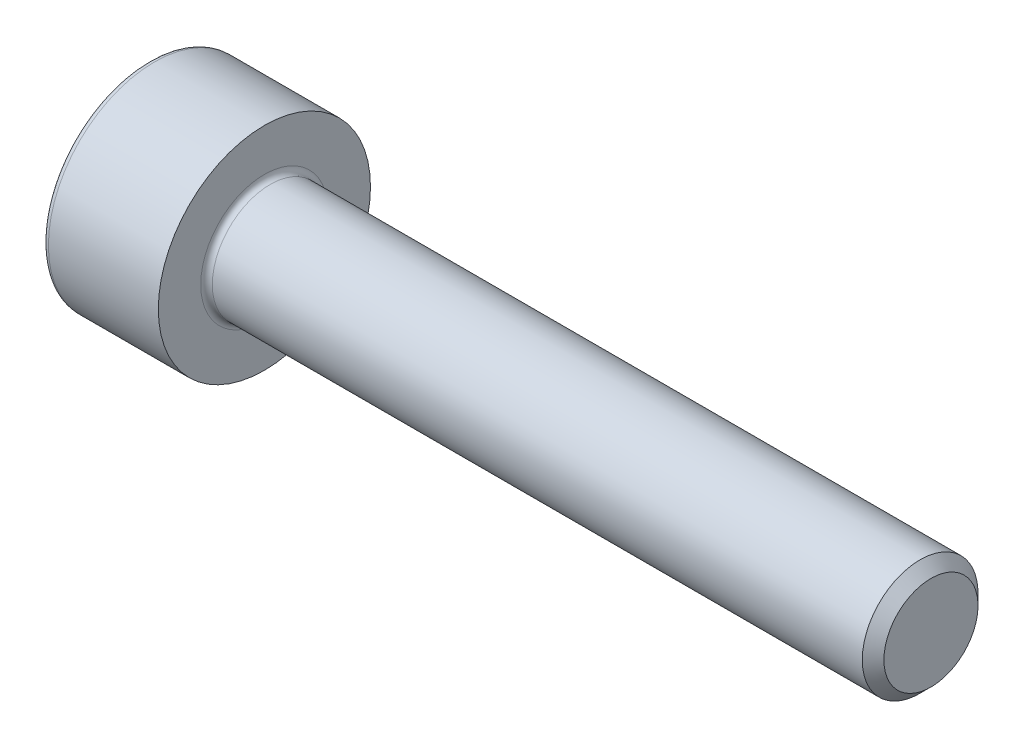
ISO-10303-21;
HEADER;
FILE_DESCRIPTION(('STEP AP214'),'2;1');
FILE_NAME('part.step','',(''),(''),'','','');
FILE_SCHEMA(('AUTOMOTIVE_DESIGN { 1 0 10303 214 1 1 1 1 }'));
ENDSEC;
DATA;
#1=APPLICATION_CONTEXT('core data for automotive mechanical design processes');
#2=APPLICATION_PROTOCOL_DEFINITION('international standard','automotive_design',2000,#1);
#3=PRODUCT_CONTEXT('',#1,'mechanical');
#4=PRODUCT('Part','Part','',(#3));
#5=PRODUCT_RELATED_PRODUCT_CATEGORY('part','',(#4));
#6=PRODUCT_DEFINITION_FORMATION('','',#4);
#7=PRODUCT_DEFINITION_CONTEXT('part definition',#1,'design');
#8=PRODUCT_DEFINITION('design','',#6,#7);
#9=PRODUCT_DEFINITION_SHAPE('','',#8);
#10=(LENGTH_UNIT() NAMED_UNIT(*) SI_UNIT(.MILLI.,.METRE.));
#11=(NAMED_UNIT(*) PLANE_ANGLE_UNIT() SI_UNIT($,.RADIAN.));
#12=(NAMED_UNIT(*) SI_UNIT($,.STERADIAN.) SOLID_ANGLE_UNIT());
#13=UNCERTAINTY_MEASURE_WITH_UNIT(LENGTH_MEASURE(1.E-05),#10,'distance_accuracy_value','');
#14=(GEOMETRIC_REPRESENTATION_CONTEXT(3) GLOBAL_UNCERTAINTY_ASSIGNED_CONTEXT((#13)) GLOBAL_UNIT_ASSIGNED_CONTEXT((#10,
#11,#12)) REPRESENTATION_CONTEXT('',''));
#15=CARTESIAN_POINT('',(0.,0.,0.));
#16=DIRECTION('',(0.,0.,1.));
#17=DIRECTION('',(1.,0.,0.));
#18=AXIS2_PLACEMENT_3D('',#15,#16,#17);
#19=CARTESIAN_POINT('',(-15.512494932035,0.,0.451171875000001));
#20=DIRECTION('',(-1.,0.,0.));
#21=DIRECTION('',(0.,0.,1.));
#22=AXIS2_PLACEMENT_3D('',#19,#20,#21);
#23=CYLINDRICAL_SURFACE('',#22,2.75);
#24=CARTESIAN_POINT('',(-11.29921875,0.,0.451171875000001));
#25=DIRECTION('',(1.,0.,0.));
#26=DIRECTION('',(0.,0.,-1.));
#27=AXIS2_PLACEMENT_3D('',#24,#25,#26);
#28=CIRCLE('',#27,2.75);
#29=CARTESIAN_POINT('',(-11.29921875,0.,-2.298828125));
#30=VERTEX_POINT('',#29);
#31=EDGE_CURVE('E11',#30,#30,#28,.T.);
#32=ORIENTED_EDGE('',*,*,#31,.T.);
#33=EDGE_LOOP('',(#32));
#34=FACE_BOUND('',#33,.T.);
#35=CARTESIAN_POINT('',(-8.44921875,0.,0.451171875000001));
#36=DIRECTION('',(-1.,0.,0.));
#37=DIRECTION('',(0.,0.,1.));
#38=AXIS2_PLACEMENT_3D('',#35,#36,#37);
#39=CIRCLE('',#38,2.75);
#40=CARTESIAN_POINT('',(-8.44921875,0.,3.201171875));
#41=VERTEX_POINT('',#40);
#42=EDGE_CURVE('E146',#41,#41,#39,.T.);
#43=ORIENTED_EDGE('',*,*,#42,.T.);
#44=EDGE_LOOP('',(#43));
#45=FACE_BOUND('',#44,.T.);
#46=ADVANCED_FACE('F33',(#34,#45),#23,.T.);
#47=CARTESIAN_POINT('',(-8.44921875,0.,-2.298828125));
#48=DIRECTION('',(-1.,0.,0.));
#49=DIRECTION('',(0.,0.,1.));
#50=AXIS2_PLACEMENT_3D('',#47,#48,#49);
#51=PLANE('',#50);
#52=CARTESIAN_POINT('',(-8.44921875,0.,0.451171875000001));
#53=DIRECTION('',(-1.,0.,0.));
#54=DIRECTION('',(0.,0.,1.));
#55=AXIS2_PLACEMENT_3D('',#52,#53,#54);
#56=CIRCLE('',#55,1.65);
#57=CARTESIAN_POINT('',(-8.44921875,0.,2.101171875));
#58=VERTEX_POINT('',#57);
#59=EDGE_CURVE('E149',#58,#58,#56,.T.);
#60=ORIENTED_EDGE('',*,*,#59,.T.);
#61=EDGE_LOOP('',(#60));
#62=FACE_BOUND('',#61,.T.);
#63=ORIENTED_EDGE('',*,*,#42,.F.);
#64=EDGE_LOOP('',(#63));
#65=FACE_BOUND('',#64,.T.);
#66=ADVANCED_FACE('F172',(#62,#65),#51,.F.);
#67=CARTESIAN_POINT('',(-15.512494932035,0.,0.451171875000001));
#68=DIRECTION('',(-1.,0.,0.));
#69=DIRECTION('',(0.,0.,1.));
#70=AXIS2_PLACEMENT_3D('',#67,#68,#69);
#71=CYLINDRICAL_SURFACE('',#70,1.5);
#72=CARTESIAN_POINT('',(-8.29921875,0.,0.451171875000001));
#73=DIRECTION('',(-1.,0.,0.));
#74=DIRECTION('',(0.,0.,1.));
#75=AXIS2_PLACEMENT_3D('',#72,#73,#74);
#76=CIRCLE('',#75,1.5);
#77=CARTESIAN_POINT('',(-8.29921875,0.,1.951171875));
#78=VERTEX_POINT('',#77);
#79=EDGE_CURVE('E152',#78,#78,#76,.F.);
#80=ORIENTED_EDGE('',*,*,#79,.T.);
#81=EDGE_LOOP('',(#80));
#82=FACE_BOUND('',#81,.T.);
#83=CARTESIAN_POINT('',(8.55078125000001,0.,0.451171875000001));
#84=DIRECTION('',(-1.,0.,0.));
#85=DIRECTION('',(0.,0.,1.));
#86=AXIS2_PLACEMENT_3D('',#83,#84,#85);
#87=CIRCLE('',#86,1.5);
#88=CARTESIAN_POINT('',(8.55078125000001,0.,1.951171875));
#89=VERTEX_POINT('',#88);
#90=EDGE_CURVE('E143',#89,#89,#87,.T.);
#91=ORIENTED_EDGE('',*,*,#90,.T.);
#92=EDGE_LOOP('',(#91));
#93=FACE_BOUND('',#92,.T.);
#94=ADVANCED_FACE('F178',(#82,#93),#71,.T.);
#95=CARTESIAN_POINT('',(8.83128125,0.,0.451171875000001));
#96=DIRECTION('',(-1.,0.,0.));
#97=DIRECTION('',(0.,0.,1.));
#98=AXIS2_PLACEMENT_3D('',#95,#96,#97);
#99=CONICAL_SURFACE('',#98,1.2195,0.785398163397452);
#100=ORIENTED_EDGE('',*,*,#90,.F.);
#101=EDGE_LOOP('',(#100));
#102=FACE_BOUND('',#101,.T.);
#103=CARTESIAN_POINT('',(8.83128125,0.,0.451171875000001));
#104=DIRECTION('',(-1.,0.,0.));
#105=DIRECTION('',(0.,0.,1.));
#106=AXIS2_PLACEMENT_3D('',#103,#104,#105);
#107=CIRCLE('',#106,1.2195);
#108=CARTESIAN_POINT('',(8.83128125,0.,1.670671875));
#109=VERTEX_POINT('',#108);
#110=EDGE_CURVE('E135',#109,#109,#107,.T.);
#111=ORIENTED_EDGE('',*,*,#110,.T.);
#112=EDGE_LOOP('',(#111));
#113=FACE_BOUND('',#112,.T.);
#114=ADVANCED_FACE('F185',(#102,#113),#99,.T.);
#115=CARTESIAN_POINT('',(8.83128125,0.,-0.768328125000001));
#116=DIRECTION('',(-1.,0.,0.));
#117=DIRECTION('',(0.,0.,1.));
#118=AXIS2_PLACEMENT_3D('',#115,#116,#117);
#119=PLANE('',#118);
#120=ORIENTED_EDGE('',*,*,#110,.F.);
#121=EDGE_LOOP('',(#120));
#122=FACE_BOUND('',#121,.T.);
#123=ADVANCED_FACE('F189',(#122),#119,.F.);
#124=CARTESIAN_POINT('',(-11.44921875,0.,-2.298828125));
#125=DIRECTION('',(1.,0.,0.));
#126=DIRECTION('',(0.,0.,-1.));
#127=AXIS2_PLACEMENT_3D('',#124,#125,#126);
#128=PLANE('',#127);
#129=DIRECTION('',(0.,0.86600143354083,0.5000415153817));
#130=VECTOR('',#129,1.);
#131=CARTESIAN_POINT('',(-11.44921875,-1.28003542770676,1.19011885872373));
#132=LINE('',#131,#130);
#133=CARTESIAN_POINT('',(-11.44921875,-1.28003542770676,1.19011885872373));
#134=VERTEX_POINT('',#133);
#135=CARTESIAN_POINT('',(-11.44921875,-7.08538987480929E-05,1.929188565));
#136=VERTEX_POINT('',#135);
#137=EDGE_CURVE('E122',#134,#136,#132,.T.);
#138=ORIENTED_EDGE('',*,*,#137,.F.);
#139=DIRECTION('',(0.,-4.79384970050447E-05,0.99999999885095));
#140=VECTOR('',#139,1.);
#141=CARTESIAN_POINT('',(-11.44921875,-1.27996457380801,-0.287897831276273));
#142=LINE('',#141,#140);
#143=CARTESIAN_POINT('',(-11.44921875,-1.27996457380801,-0.287897831276273));
#144=VERTEX_POINT('',#143);
#145=EDGE_CURVE('E48',#144,#134,#142,.T.);
#146=ORIENTED_EDGE('',*,*,#145,.F.);
#147=DIRECTION('',(0.,-0.866049372037835,0.499958483469249));
#148=VECTOR('',#147,1.);
#149=CARTESIAN_POINT('',(-11.44921875,7.08538987488194E-05,-1.026844815));
#150=LINE('',#149,#148);
#151=CARTESIAN_POINT('',(-11.44921875,7.08538987488194E-05,-1.026844815));
#152=VERTEX_POINT('',#151);
#153=EDGE_CURVE('E131',#152,#144,#150,.T.);
#154=ORIENTED_EDGE('',*,*,#153,.F.);
#155=DIRECTION('',(0.,-0.86600143354083,-0.500041515381701));
#156=VECTOR('',#155,1.);
#157=CARTESIAN_POINT('',(-11.44921875,1.28003542770676,-0.287775108723727));
#158=LINE('',#157,#156);
#159=CARTESIAN_POINT('',(-11.44921875,1.28003542770676,-0.287775108723727));
#160=VERTEX_POINT('',#159);
#161=EDGE_CURVE('E129',#160,#152,#158,.T.);
#162=ORIENTED_EDGE('',*,*,#161,.F.);
#163=DIRECTION('',(0.,4.79384970050447E-05,-0.99999999885095));
#164=VECTOR('',#163,1.);
#165=CARTESIAN_POINT('',(-11.44921875,1.27996457380801,1.19024158127627));
#166=LINE('',#165,#164);
#167=CARTESIAN_POINT('',(-11.44921875,1.27996457380801,1.19024158127627));
#168=VERTEX_POINT('',#167);
#169=EDGE_CURVE('E96',#168,#160,#166,.T.);
#170=ORIENTED_EDGE('',*,*,#169,.F.);
#171=DIRECTION('',(0.,0.866049372037835,-0.499958483469249));
#172=VECTOR('',#171,1.);
#173=CARTESIAN_POINT('',(-11.44921875,-7.08538987480929E-05,1.929188565));
#174=LINE('',#173,#172);
#175=EDGE_CURVE('E125',#136,#168,#174,.T.);
#176=ORIENTED_EDGE('',*,*,#175,.F.);
#177=EDGE_LOOP('',(#138,#146,#154,#162,#170,#176));
#178=FACE_BOUND('',#177,.T.);
#179=CARTESIAN_POINT('',(-11.44921875,0.,0.451171875000001));
#180=DIRECTION('',(1.,0.,0.));
#181=DIRECTION('',(0.,0.,-1.));
#182=AXIS2_PLACEMENT_3D('',#179,#180,#181);
#183=CIRCLE('',#182,2.6);
#184=CARTESIAN_POINT('',(-11.44921875,0.,-2.148828125));
#185=VERTEX_POINT('',#184);
#186=EDGE_CURVE('E41',#185,#185,#183,.F.);
#187=ORIENTED_EDGE('',*,*,#186,.T.);
#188=EDGE_LOOP('',(#187));
#189=FACE_BOUND('',#188,.T.);
#190=ADVANCED_FACE('F157',(#178,#189),#128,.F.);
#191=CARTESIAN_POINT('',(-8.29921875,0.,0.451171875000001));
#192=DIRECTION('',(-1.,0.,0.));
#193=DIRECTION('',(0.,0.,1.));
#194=AXIS2_PLACEMENT_3D('',#191,#192,#193);
#195=TOROIDAL_SURFACE('',#194,1.65,0.15);
#196=ORIENTED_EDGE('',*,*,#79,.F.);
#197=EDGE_LOOP('',(#196));
#198=FACE_BOUND('',#197,.T.);
#199=ORIENTED_EDGE('',*,*,#59,.F.);
#200=EDGE_LOOP('',(#199));
#201=FACE_BOUND('',#200,.T.);
#202=ADVANCED_FACE('F161',(#198,#201),#195,.F.);
#203=CARTESIAN_POINT('',(-11.29921875,0.,0.451171875000001));
#204=DIRECTION('',(1.,0.,0.));
#205=DIRECTION('',(0.,0.,-1.));
#206=AXIS2_PLACEMENT_3D('',#203,#204,#205);
#207=TOROIDAL_SURFACE('',#206,2.6,0.15);
#208=ORIENTED_EDGE('',*,*,#31,.F.);
#209=EDGE_LOOP('',(#208));
#210=FACE_BOUND('',#209,.T.);
#211=ORIENTED_EDGE('',*,*,#186,.F.);
#212=EDGE_LOOP('',(#211));
#213=FACE_BOUND('',#212,.T.);
#214=ADVANCED_FACE('F35',(#210,#213),#207,.T.);
#215=CARTESIAN_POINT('',(-10.44921875,-1.27996457380801,-0.287897831276273));
#216=DIRECTION('',(0.,-0.99999999885095,-4.79384970050447E-05));
#217=DIRECTION('',(0.,4.79384970050447E-05,-0.99999999885095));
#218=AXIS2_PLACEMENT_3D('',#215,#216,#217);
#219=PLANE('',#218);
#220=ORIENTED_EDGE('',*,*,#145,.T.);
#221=DIRECTION('',(-1.,0.,0.));
#222=VECTOR('',#221,1.);
#223=CARTESIAN_POINT('',(-10.44921875,-1.28003542770676,1.19011885872373));
#224=LINE('',#223,#222);
#225=CARTESIAN_POINT('',(-10.44921875,-1.28003542770676,1.19011885872373));
#226=VERTEX_POINT('',#225);
#227=EDGE_CURVE('E78',#226,#134,#224,.T.);
#228=ORIENTED_EDGE('',*,*,#227,.F.);
#229=DIRECTION('',(0.,-4.79384970050447E-05,0.99999999885095));
#230=VECTOR('',#229,1.);
#231=CARTESIAN_POINT('',(-10.44921875,-1.27996457380801,-0.287897831276273));
#232=LINE('',#231,#230);
#233=CARTESIAN_POINT('',(-10.44921875,-1.27996457380801,-0.287897831276273));
#234=VERTEX_POINT('',#233);
#235=EDGE_CURVE('E133',#234,#226,#232,.T.);
#236=ORIENTED_EDGE('',*,*,#235,.F.);
#237=DIRECTION('',(-1.,0.,0.));
#238=VECTOR('',#237,1.);
#239=CARTESIAN_POINT('',(-10.44921875,-1.27996457380801,-0.287897831276273));
#240=LINE('',#239,#238);
#241=EDGE_CURVE('E56',#234,#144,#240,.T.);
#242=ORIENTED_EDGE('',*,*,#241,.T.);
#243=EDGE_LOOP('',(#220,#228,#236,#242));
#244=FACE_BOUND('',#243,.T.);
#245=ADVANCED_FACE('F160',(#244),#219,.F.);
#246=CARTESIAN_POINT('',(-10.44921875,7.08538987488194E-05,-1.026844815));
#247=DIRECTION('',(0.,-0.499958483469249,-0.866049372037835));
#248=DIRECTION('',(0.,0.866049372037835,-0.499958483469249));
#249=AXIS2_PLACEMENT_3D('',#246,#247,#248);
#250=PLANE('',#249);
#251=ORIENTED_EDGE('',*,*,#153,.T.);
#252=ORIENTED_EDGE('',*,*,#241,.F.);
#253=DIRECTION('',(0.,-0.866049372037835,0.499958483469249));
#254=VECTOR('',#253,1.);
#255=CARTESIAN_POINT('',(-10.44921875,7.08538987488194E-05,-1.026844815));
#256=LINE('',#255,#254);
#257=CARTESIAN_POINT('',(-10.44921875,7.08538987488194E-05,-1.026844815));
#258=VERTEX_POINT('',#257);
#259=EDGE_CURVE('E108',#258,#234,#256,.T.);
#260=ORIENTED_EDGE('',*,*,#259,.F.);
#261=DIRECTION('',(-1.,0.,0.));
#262=VECTOR('',#261,1.);
#263=CARTESIAN_POINT('',(-10.44921875,7.08538987488194E-05,-1.026844815));
#264=LINE('',#263,#262);
#265=EDGE_CURVE('E100',#258,#152,#264,.T.);
#266=ORIENTED_EDGE('',*,*,#265,.T.);
#267=EDGE_LOOP('',(#251,#252,#260,#266));
#268=FACE_BOUND('',#267,.T.);
#269=ADVANCED_FACE('F167',(#268),#250,.F.);
#270=CARTESIAN_POINT('',(-10.44921875,1.28003542770676,-0.287775108723727));
#271=DIRECTION('',(0.,0.500041515381701,-0.86600143354083));
#272=DIRECTION('',(0.,0.86600143354083,0.500041515381701));
#273=AXIS2_PLACEMENT_3D('',#270,#271,#272);
#274=PLANE('',#273);
#275=ORIENTED_EDGE('',*,*,#161,.T.);
#276=ORIENTED_EDGE('',*,*,#265,.F.);
#277=DIRECTION('',(0.,-0.86600143354083,-0.500041515381701));
#278=VECTOR('',#277,1.);
#279=CARTESIAN_POINT('',(-10.44921875,1.28003542770676,-0.287775108723727));
#280=LINE('',#279,#278);
#281=CARTESIAN_POINT('',(-10.44921875,1.28003542770676,-0.287775108723727));
#282=VERTEX_POINT('',#281);
#283=EDGE_CURVE('E104',#282,#258,#280,.T.);
#284=ORIENTED_EDGE('',*,*,#283,.F.);
#285=DIRECTION('',(-1.,0.,0.));
#286=VECTOR('',#285,1.);
#287=CARTESIAN_POINT('',(-10.44921875,1.28003542770676,-0.287775108723727));
#288=LINE('',#287,#286);
#289=EDGE_CURVE('E89',#282,#160,#288,.T.);
#290=ORIENTED_EDGE('',*,*,#289,.T.);
#291=EDGE_LOOP('',(#275,#276,#284,#290));
#292=FACE_BOUND('',#291,.T.);
#293=ADVANCED_FACE('F105',(#292),#274,.F.);
#294=CARTESIAN_POINT('',(-10.44921875,1.27996457380801,1.19024158127627));
#295=DIRECTION('',(0.,0.99999999885095,4.79384970050447E-05));
#296=DIRECTION('',(0.,-4.79384970050447E-05,0.99999999885095));
#297=AXIS2_PLACEMENT_3D('',#294,#295,#296);
#298=PLANE('',#297);
#299=ORIENTED_EDGE('',*,*,#169,.T.);
#300=ORIENTED_EDGE('',*,*,#289,.F.);
#301=DIRECTION('',(0.,4.79384970050447E-05,-0.99999999885095));
#302=VECTOR('',#301,1.);
#303=CARTESIAN_POINT('',(-10.44921875,1.27996457380801,1.19024158127627));
#304=LINE('',#303,#302);
#305=CARTESIAN_POINT('',(-10.44921875,1.27996457380801,1.19024158127627));
#306=VERTEX_POINT('',#305);
#307=EDGE_CURVE('E93',#306,#282,#304,.T.);
#308=ORIENTED_EDGE('',*,*,#307,.F.);
#309=DIRECTION('',(-1.,0.,0.));
#310=VECTOR('',#309,1.);
#311=CARTESIAN_POINT('',(-10.44921875,1.27996457380801,1.19024158127627));
#312=LINE('',#311,#310);
#313=EDGE_CURVE('E101',#306,#168,#312,.T.);
#314=ORIENTED_EDGE('',*,*,#313,.T.);
#315=EDGE_LOOP('',(#299,#300,#308,#314));
#316=FACE_BOUND('',#315,.T.);
#317=ADVANCED_FACE('F91',(#316),#298,.F.);
#318=CARTESIAN_POINT('',(-10.44921875,-7.08538987480929E-05,1.929188565));
#319=DIRECTION('',(0.,0.499958483469249,0.866049372037835));
#320=DIRECTION('',(0.,-0.866049372037835,0.499958483469249));
#321=AXIS2_PLACEMENT_3D('',#318,#319,#320);
#322=PLANE('',#321);
#323=ORIENTED_EDGE('',*,*,#175,.T.);
#324=ORIENTED_EDGE('',*,*,#313,.F.);
#325=DIRECTION('',(0.,0.866049372037835,-0.499958483469249));
#326=VECTOR('',#325,1.);
#327=CARTESIAN_POINT('',(-10.44921875,-7.08538987480929E-05,1.929188565));
#328=LINE('',#327,#326);
#329=CARTESIAN_POINT('',(-10.44921875,-7.08538987480929E-05,1.929188565));
#330=VERTEX_POINT('',#329);
#331=EDGE_CURVE('E114',#330,#306,#328,.T.);
#332=ORIENTED_EDGE('',*,*,#331,.F.);
#333=DIRECTION('',(-1.,0.,0.));
#334=VECTOR('',#333,1.);
#335=CARTESIAN_POINT('',(-10.44921875,-7.08538987480929E-05,1.929188565));
#336=LINE('',#335,#334);
#337=EDGE_CURVE('E138',#330,#136,#336,.T.);
#338=ORIENTED_EDGE('',*,*,#337,.T.);
#339=EDGE_LOOP('',(#323,#324,#332,#338));
#340=FACE_BOUND('',#339,.T.);
#341=ADVANCED_FACE('F200',(#340),#322,.F.);
#342=CARTESIAN_POINT('',(-10.44921875,-1.28003542770676,1.19011885872373));
#343=DIRECTION('',(0.,-0.5000415153817,0.86600143354083));
#344=DIRECTION('',(0.,-0.86600143354083,-0.5000415153817));
#345=AXIS2_PLACEMENT_3D('',#342,#343,#344);
#346=PLANE('',#345);
#347=ORIENTED_EDGE('',*,*,#137,.T.);
#348=ORIENTED_EDGE('',*,*,#337,.F.);
#349=DIRECTION('',(0.,0.86600143354083,0.5000415153817));
#350=VECTOR('',#349,1.);
#351=CARTESIAN_POINT('',(-10.44921875,-1.28003542770676,1.19011885872373));
#352=LINE('',#351,#350);
#353=EDGE_CURVE('E116',#226,#330,#352,.T.);
#354=ORIENTED_EDGE('',*,*,#353,.F.);
#355=ORIENTED_EDGE('',*,*,#227,.T.);
#356=EDGE_LOOP('',(#347,#348,#354,#355));
#357=FACE_BOUND('',#356,.T.);
#358=ADVANCED_FACE('F197',(#357),#346,.F.);
#359=CARTESIAN_POINT('',(-10.44921875,0.,0.));
#360=DIRECTION('',(-1.,0.,0.));
#361=DIRECTION('',(0.,0.,1.));
#362=AXIS2_PLACEMENT_3D('',#359,#360,#361);
#363=PLANE('',#362);
#364=ORIENTED_EDGE('',*,*,#235,.T.);
#365=ORIENTED_EDGE('',*,*,#353,.T.);
#366=ORIENTED_EDGE('',*,*,#331,.T.);
#367=ORIENTED_EDGE('',*,*,#307,.T.);
#368=ORIENTED_EDGE('',*,*,#283,.T.);
#369=ORIENTED_EDGE('',*,*,#259,.T.);
#370=EDGE_LOOP('',(#364,#365,#366,#367,#368,#369));
#371=FACE_BOUND('',#370,.T.);
#372=ADVANCED_FACE('F111',(#371),#363,.T.);
#373=CLOSED_SHELL('',(#46,#66,#94,#114,#123,#190,#202,#214,#245,#269,#293,#317,#341,#358,#372));
#374=MANIFOLD_SOLID_BREP('B2',#373);
#375=ADVANCED_BREP_SHAPE_REPRESENTATION('',(#18,#374),#14);
#376=SHAPE_DEFINITION_REPRESENTATION(#9,#375);
ENDSEC;
END-ISO-10303-21;
